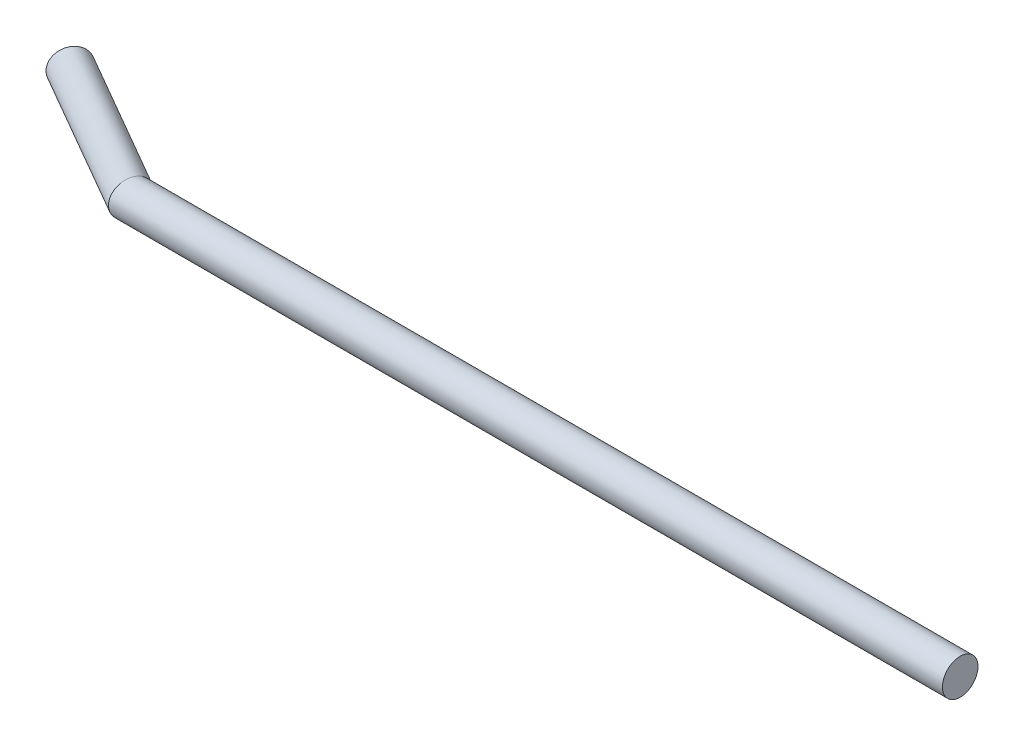
ISO-10303-21;
HEADER;
FILE_DESCRIPTION(('STEP AP214'),'2;1');
FILE_NAME('part.step','',(''),(''),'','','');
FILE_SCHEMA(('AUTOMOTIVE_DESIGN { 1 0 10303 214 1 1 1 1 }'));
ENDSEC;
DATA;
#1=APPLICATION_CONTEXT('core data for automotive mechanical design processes');
#2=APPLICATION_PROTOCOL_DEFINITION('international standard','automotive_design',2000,#1);
#3=PRODUCT_CONTEXT('',#1,'mechanical');
#4=PRODUCT('Part','Part','',(#3));
#5=PRODUCT_RELATED_PRODUCT_CATEGORY('part','',(#4));
#6=PRODUCT_DEFINITION_FORMATION('','',#4);
#7=PRODUCT_DEFINITION_CONTEXT('part definition',#1,'design');
#8=PRODUCT_DEFINITION('design','',#6,#7);
#9=PRODUCT_DEFINITION_SHAPE('','',#8);
#10=(LENGTH_UNIT() NAMED_UNIT(*) SI_UNIT(.MILLI.,.METRE.));
#11=(NAMED_UNIT(*) PLANE_ANGLE_UNIT() SI_UNIT($,.RADIAN.));
#12=(NAMED_UNIT(*) SI_UNIT($,.STERADIAN.) SOLID_ANGLE_UNIT());
#13=UNCERTAINTY_MEASURE_WITH_UNIT(LENGTH_MEASURE(1.E-05),#10,'distance_accuracy_value','');
#14=(GEOMETRIC_REPRESENTATION_CONTEXT(3) GLOBAL_UNCERTAINTY_ASSIGNED_CONTEXT((#13)) GLOBAL_UNIT_ASSIGNED_CONTEXT((#10,
#11,#12)) REPRESENTATION_CONTEXT('',''));
#15=CARTESIAN_POINT('',(0.,0.,0.));
#16=DIRECTION('',(0.,0.,1.));
#17=DIRECTION('',(1.,0.,0.));
#18=AXIS2_PLACEMENT_3D('',#15,#16,#17);
#19=CARTESIAN_POINT('',(-82.1243556529821,0.,-7.));
#20=DIRECTION('',(0.866025403784438,0.,0.500000000000002));
#21=DIRECTION('',(0.500000000000002,0.,-0.866025403784438));
#22=AXIS2_PLACEMENT_3D('',#19,#20,#21);
#23=PLANE('',#22);
#24=CARTESIAN_POINT('',(-82.1243556529821,0.,-7.));
#25=DIRECTION('',(0.866025403784438,0.,0.500000000000002));
#26=DIRECTION('',(0.500000000000002,0.,-0.866025403784438));
#27=AXIS2_PLACEMENT_3D('',#24,#25,#26);
#28=CIRCLE('',#27,1.5);
#29=CARTESIAN_POINT('',(-81.3743556529821,0.,-8.29903810567665));
#30=VERTEX_POINT('',#29);
#31=EDGE_CURVE('E38',#30,#30,#28,.T.);
#32=ORIENTED_EDGE('',*,*,#31,.F.);
#33=EDGE_LOOP('',(#32));
#34=FACE_BOUND('',#33,.T.);
#35=ADVANCED_FACE('F35',(#34),#23,.F.);
#36=CARTESIAN_POINT('',(0.,0.,0.));
#37=DIRECTION('',(1.,0.,0.));
#38=DIRECTION('',(0.,0.,-1.));
#39=AXIS2_PLACEMENT_3D('',#36,#37,#38);
#40=PLANE('',#39);
#41=CARTESIAN_POINT('',(0.,0.,0.));
#42=DIRECTION('',(1.,0.,0.));
#43=DIRECTION('',(0.,0.,-1.));
#44=AXIS2_PLACEMENT_3D('',#41,#42,#43);
#45=CIRCLE('',#44,1.5);
#46=CARTESIAN_POINT('',(0.,0.,-1.5));
#47=VERTEX_POINT('',#46);
#48=EDGE_CURVE('E43',#47,#47,#45,.T.);
#49=ORIENTED_EDGE('',*,*,#48,.T.);
#50=EDGE_LOOP('',(#49));
#51=FACE_BOUND('',#50,.T.);
#52=ADVANCED_FACE('F59',(#51),#40,.T.);
#53=CARTESIAN_POINT('',(-69.5305136271329,0.,0.271058083755698));
#54=DIRECTION('',(-0.866025403784438,0.,-0.500000000000001));
#55=DIRECTION('',(-0.500000000000001,0.,0.866025403784438));
#56=AXIS2_PLACEMENT_3D('',#53,#54,#55);
#57=CYLINDRICAL_SURFACE('',#56,1.5);
#58=CARTESIAN_POINT('',(-70.,0.,0.));
#59=DIRECTION('',(-0.965925826289068,0.,-0.258819045102521));
#60=DIRECTION('',(-0.258819045102521,0.,0.965925826289068));
#61=AXIS2_PLACEMENT_3D('',#58,#59,#60);
#62=ELLIPSE('',#61,1.55291427061513,1.5);
#63=CARTESIAN_POINT('',(-70.4019237886467,0.,1.50000000000002));
#64=VERTEX_POINT('',#63);
#65=EDGE_CURVE('E11',#64,#64,#62,.T.);
#66=ORIENTED_EDGE('',*,*,#65,.T.);
#67=EDGE_LOOP('',(#66));
#68=FACE_BOUND('',#67,.T.);
#69=ORIENTED_EDGE('',*,*,#31,.T.);
#70=EDGE_LOOP('',(#69));
#71=FACE_BOUND('',#70,.T.);
#72=ADVANCED_FACE('F57',(#68,#71),#57,.T.);
#73=CARTESIAN_POINT('',(0.,0.,0.));
#74=DIRECTION('',(-1.,0.,0.));
#75=DIRECTION('',(0.,0.,1.));
#76=AXIS2_PLACEMENT_3D('',#73,#74,#75);
#77=CYLINDRICAL_SURFACE('',#76,1.5);
#78=ORIENTED_EDGE('',*,*,#48,.F.);
#79=EDGE_LOOP('',(#78));
#80=FACE_BOUND('',#79,.T.);
#81=ORIENTED_EDGE('',*,*,#65,.F.);
#82=EDGE_LOOP('',(#81));
#83=FACE_BOUND('',#82,.T.);
#84=ADVANCED_FACE('F55',(#80,#83),#77,.T.);
#85=CLOSED_SHELL('',(#35,#52,#72,#84));
#86=MANIFOLD_SOLID_BREP('B2',#85);
#87=ADVANCED_BREP_SHAPE_REPRESENTATION('',(#18,#86),#14);
#88=SHAPE_DEFINITION_REPRESENTATION(#9,#87);
ENDSEC;
END-ISO-10303-21;
